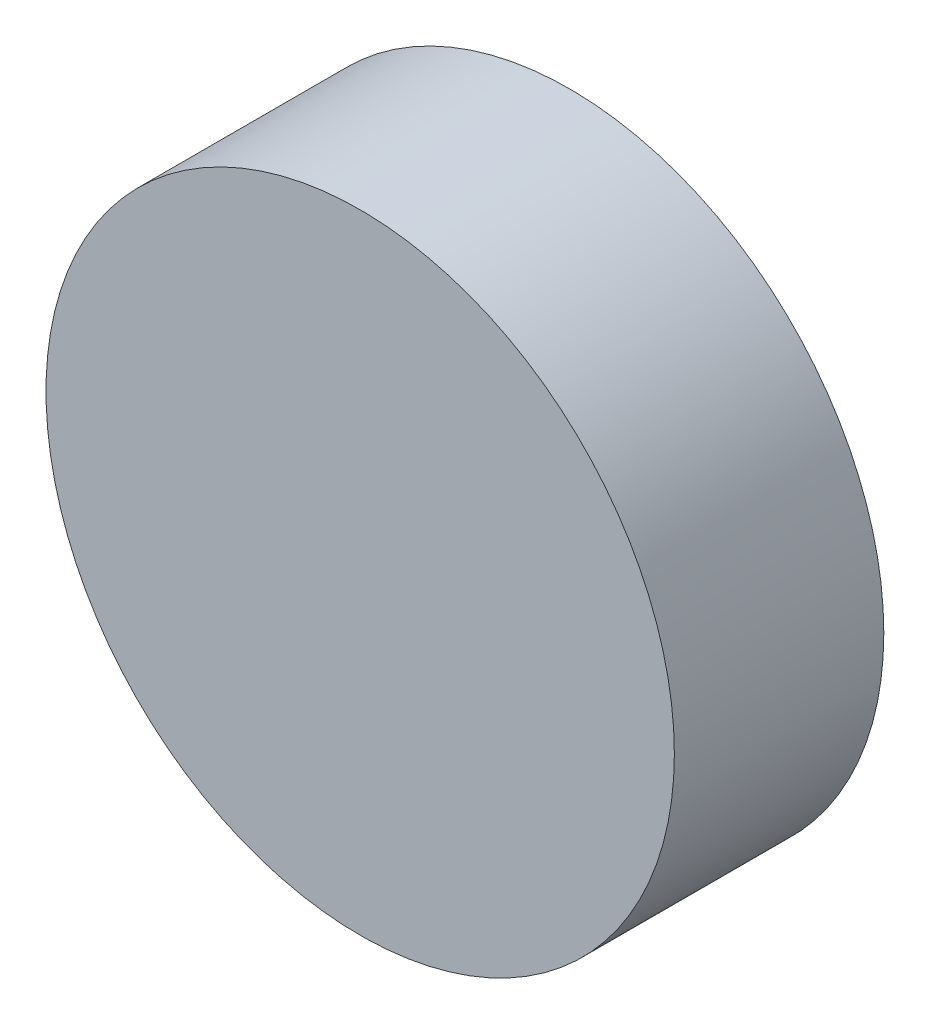
ISO-10303-21;
HEADER;
FILE_DESCRIPTION(('STEP AP214'),'2;1');
FILE_NAME('part.step','',(''),(''),'','','');
FILE_SCHEMA(('AUTOMOTIVE_DESIGN { 1 0 10303 214 1 1 1 1 }'));
ENDSEC;
DATA;
#1=APPLICATION_CONTEXT('core data for automotive mechanical design processes');
#2=APPLICATION_PROTOCOL_DEFINITION('international standard','automotive_design',2000,#1);
#3=PRODUCT_CONTEXT('',#1,'mechanical');
#4=PRODUCT('Part','Part','',(#3));
#5=PRODUCT_RELATED_PRODUCT_CATEGORY('part','',(#4));
#6=PRODUCT_DEFINITION_FORMATION('','',#4);
#7=PRODUCT_DEFINITION_CONTEXT('part definition',#1,'design');
#8=PRODUCT_DEFINITION('design','',#6,#7);
#9=PRODUCT_DEFINITION_SHAPE('','',#8);
#10=(LENGTH_UNIT() NAMED_UNIT(*) SI_UNIT(.MILLI.,.METRE.));
#11=(NAMED_UNIT(*) PLANE_ANGLE_UNIT() SI_UNIT($,.RADIAN.));
#12=(NAMED_UNIT(*) SI_UNIT($,.STERADIAN.) SOLID_ANGLE_UNIT());
#13=UNCERTAINTY_MEASURE_WITH_UNIT(LENGTH_MEASURE(1.E-05),#10,'distance_accuracy_value','');
#14=(GEOMETRIC_REPRESENTATION_CONTEXT(3) GLOBAL_UNCERTAINTY_ASSIGNED_CONTEXT((#13)) GLOBAL_UNIT_ASSIGNED_CONTEXT((#10,
#11,#12)) REPRESENTATION_CONTEXT('',''));
#15=CARTESIAN_POINT('',(0.,0.,0.));
#16=DIRECTION('',(0.,0.,1.));
#17=DIRECTION('',(1.,0.,0.));
#18=AXIS2_PLACEMENT_3D('',#15,#16,#17);
#19=CARTESIAN_POINT('',(0.,0.,25.4));
#20=DIRECTION('',(0.,0.,-1.));
#21=DIRECTION('',(-1.,0.,0.));
#22=AXIS2_PLACEMENT_3D('',#19,#20,#21);
#23=CYLINDRICAL_SURFACE('',#22,38.1);
#24=CARTESIAN_POINT('',(0.,0.,25.4));
#25=DIRECTION('',(0.,0.,1.));
#26=DIRECTION('',(1.,0.,0.));
#27=AXIS2_PLACEMENT_3D('',#24,#25,#26);
#28=CIRCLE('',#27,38.1);
#29=CARTESIAN_POINT('',(38.1,0.,25.4));
#30=VERTEX_POINT('',#29);
#31=EDGE_CURVE('E10',#30,#30,#28,.T.);
#32=ORIENTED_EDGE('',*,*,#31,.F.);
#33=EDGE_LOOP('',(#32));
#34=FACE_BOUND('',#33,.T.);
#35=CARTESIAN_POINT('',(0.,0.,0.));
#36=DIRECTION('',(0.,0.,1.));
#37=DIRECTION('',(1.,0.,0.));
#38=AXIS2_PLACEMENT_3D('',#35,#36,#37);
#39=CIRCLE('',#38,38.1);
#40=CARTESIAN_POINT('',(38.1,0.,0.));
#41=VERTEX_POINT('',#40);
#42=EDGE_CURVE('E34',#41,#41,#39,.T.);
#43=ORIENTED_EDGE('',*,*,#42,.T.);
#44=EDGE_LOOP('',(#43));
#45=FACE_BOUND('',#44,.T.);
#46=ADVANCED_FACE('F31',(#34,#45),#23,.T.);
#47=CARTESIAN_POINT('',(0.,0.,25.4));
#48=DIRECTION('',(0.,0.,1.));
#49=DIRECTION('',(1.,0.,0.));
#50=AXIS2_PLACEMENT_3D('',#47,#48,#49);
#51=PLANE('',#50);
#52=ORIENTED_EDGE('',*,*,#31,.T.);
#53=EDGE_LOOP('',(#52));
#54=FACE_BOUND('',#53,.T.);
#55=ADVANCED_FACE('F46',(#54),#51,.T.);
#56=CARTESIAN_POINT('',(0.,0.,0.));
#57=DIRECTION('',(0.,0.,1.));
#58=DIRECTION('',(1.,0.,0.));
#59=AXIS2_PLACEMENT_3D('',#56,#57,#58);
#60=PLANE('',#59);
#61=ORIENTED_EDGE('',*,*,#42,.F.);
#62=EDGE_LOOP('',(#61));
#63=FACE_BOUND('',#62,.T.);
#64=ADVANCED_FACE('F44',(#63),#60,.F.);
#65=CLOSED_SHELL('',(#46,#55,#64));
#66=MANIFOLD_SOLID_BREP('B2',#65);
#67=ADVANCED_BREP_SHAPE_REPRESENTATION('',(#18,#66),#14);
#68=SHAPE_DEFINITION_REPRESENTATION(#9,#67);
ENDSEC;
END-ISO-10303-21;
